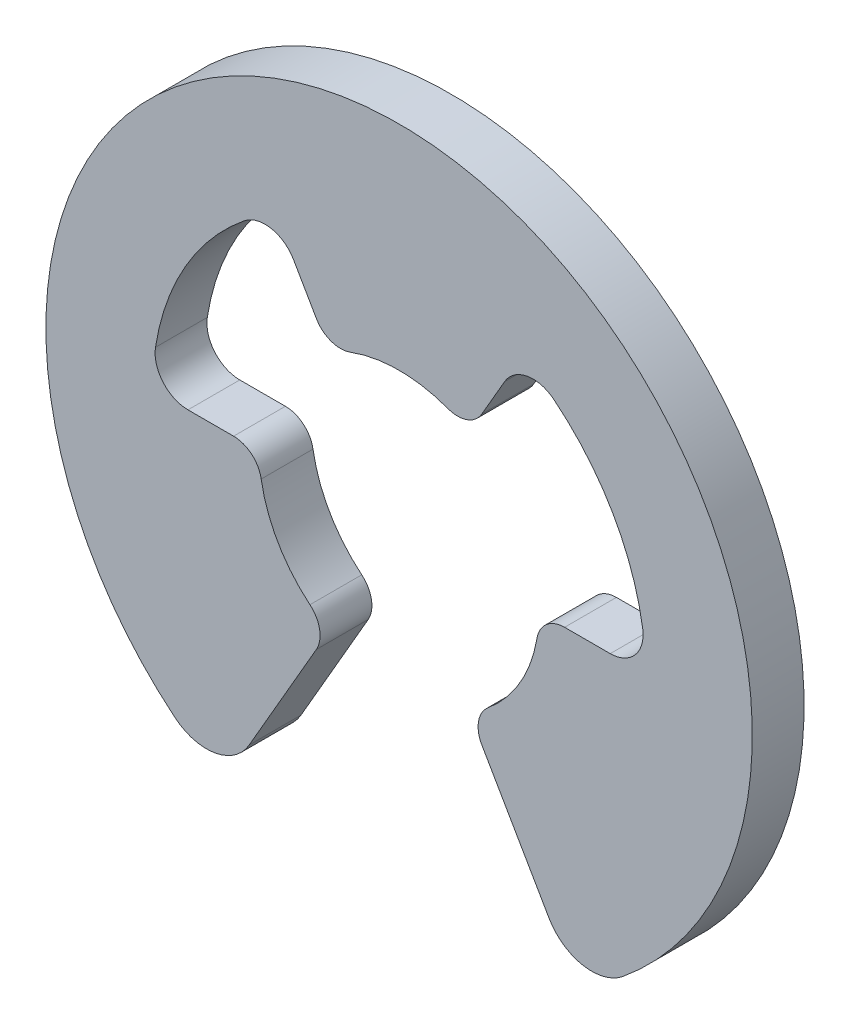
ISO-10303-21;
HEADER;
FILE_DESCRIPTION(('STEP AP214'),'2;1');
FILE_NAME('part.step','',(''),(''),'','','');
FILE_SCHEMA(('AUTOMOTIVE_DESIGN { 1 0 10303 214 1 1 1 1 }'));
ENDSEC;
DATA;
#1=APPLICATION_CONTEXT('core data for automotive mechanical design processes');
#2=APPLICATION_PROTOCOL_DEFINITION('international standard','automotive_design',2000,#1);
#3=PRODUCT_CONTEXT('',#1,'mechanical');
#4=PRODUCT('Part','Part','',(#3));
#5=PRODUCT_RELATED_PRODUCT_CATEGORY('part','',(#4));
#6=PRODUCT_DEFINITION_FORMATION('','',#4);
#7=PRODUCT_DEFINITION_CONTEXT('part definition',#1,'design');
#8=PRODUCT_DEFINITION('design','',#6,#7);
#9=PRODUCT_DEFINITION_SHAPE('','',#8);
#10=(LENGTH_UNIT() NAMED_UNIT(*) SI_UNIT(.MILLI.,.METRE.));
#11=(NAMED_UNIT(*) PLANE_ANGLE_UNIT() SI_UNIT($,.RADIAN.));
#12=(NAMED_UNIT(*) SI_UNIT($,.STERADIAN.) SOLID_ANGLE_UNIT());
#13=UNCERTAINTY_MEASURE_WITH_UNIT(LENGTH_MEASURE(1.E-05),#10,'distance_accuracy_value','');
#14=(GEOMETRIC_REPRESENTATION_CONTEXT(3) GLOBAL_UNCERTAINTY_ASSIGNED_CONTEXT((#13)) GLOBAL_UNIT_ASSIGNED_CONTEXT((#10,
#11,#12)) REPRESENTATION_CONTEXT('',''));
#15=CARTESIAN_POINT('',(0.,0.,0.));
#16=DIRECTION('',(0.,0.,1.));
#17=DIRECTION('',(1.,0.,0.));
#18=AXIS2_PLACEMENT_3D('',#15,#16,#17);
#19=CARTESIAN_POINT('',(2.59745250719341,-3.16922971270618,0.34925));
#20=DIRECTION('',(0.,0.,1.));
#21=DIRECTION('',(1.,0.,0.));
#22=AXIS2_PLACEMENT_3D('',#19,#20,#21);
#23=PLANE('',#22);
#24=CARTESIAN_POINT('',(1.44239918874713,-1.74392867970615,0.34925));
#25=DIRECTION('',(0.,0.,1.));
#26=DIRECTION('',(1.,0.,0.));
#27=AXIS2_PLACEMENT_3D('',#24,#25,#26);
#28=CIRCLE('',#27,0.37719);
#29=CARTESIAN_POINT('',(1.11574306669367,-1.93252367970615,0.34925));
#30=VERTEX_POINT('',#29);
#31=CARTESIAN_POINT('',(1.20199932395594,-1.45327389975513,0.34925));
#32=VERTEX_POINT('',#31);
#33=EDGE_CURVE('E200',#30,#32,#28,.F.);
#34=ORIENTED_EDGE('',*,*,#33,.F.);
#35=DIRECTION('',(-0.5,0.866025403784439,0.));
#36=VECTOR('',#35,1.);
#37=CARTESIAN_POINT('',(1.11574306669367,-1.93252367970615,0.34925));
#38=LINE('',#37,#36);
#39=CARTESIAN_POINT('',(2.02167984761435,-3.50165221270617,0.34925));
#40=VERTEX_POINT('',#39);
#41=EDGE_CURVE('E180',#30,#40,#38,.F.);
#42=ORIENTED_EDGE('',*,*,#41,.T.);
#43=CARTESIAN_POINT('',(2.59745250719341,-3.16922971270618,0.34925));
#44=DIRECTION('',(0.,0.,1.));
#45=DIRECTION('',(1.,0.,0.));
#46=AXIS2_PLACEMENT_3D('',#43,#44,#45);
#47=CIRCLE('',#46,0.664845);
#48=CARTESIAN_POINT('',(3.01888947837449,-3.68343760193651,0.34925));
#49=VERTEX_POINT('',#48);
#50=EDGE_CURVE('E20',#40,#49,#47,.T.);
#51=ORIENTED_EDGE('',*,*,#50,.T.);
#52=CARTESIAN_POINT('',(0.,0.,0.34925));
#53=DIRECTION('',(0.,0.,1.));
#54=DIRECTION('',(1.,0.,0.));
#55=AXIS2_PLACEMENT_3D('',#52,#53,#54);
#56=CIRCLE('',#55,4.7625);
#57=CARTESIAN_POINT('',(-3.01888950424871,-3.68343758073039,0.34925));
#58=VERTEX_POINT('',#57);
#59=EDGE_CURVE('E177',#58,#49,#56,.F.);
#60=ORIENTED_EDGE('',*,*,#59,.F.);
#61=CARTESIAN_POINT('',(-2.59745250719341,-3.16922971270618,0.34925));
#62=DIRECTION('',(0.,0.,1.));
#63=DIRECTION('',(1.,0.,0.));
#64=AXIS2_PLACEMENT_3D('',#61,#62,#63);
#65=CIRCLE('',#64,0.664845);
#66=CARTESIAN_POINT('',(-2.02167984761436,-3.50165221270616,0.34925));
#67=VERTEX_POINT('',#66);
#68=EDGE_CURVE('E187',#67,#58,#65,.F.);
#69=ORIENTED_EDGE('',*,*,#68,.F.);
#70=DIRECTION('',(-0.5,-0.866025403784439,0.));
#71=VECTOR('',#70,1.);
#72=CARTESIAN_POINT('',(-2.02167984761436,-3.50165221270616,0.34925));
#73=LINE('',#72,#71);
#74=CARTESIAN_POINT('',(-1.11574306669368,-1.93252367970615,0.34925));
#75=VERTEX_POINT('',#74);
#76=EDGE_CURVE('E271',#67,#75,#73,.F.);
#77=ORIENTED_EDGE('',*,*,#76,.T.);
#78=CARTESIAN_POINT('',(-1.44239918874713,-1.74392867970615,0.34925));
#79=DIRECTION('',(0.,0.,1.));
#80=DIRECTION('',(1.,0.,0.));
#81=AXIS2_PLACEMENT_3D('',#78,#79,#80);
#82=CIRCLE('',#81,0.37719);
#83=CARTESIAN_POINT('',(-1.20199933201188,-1.45327389309208,0.34925));
#84=VERTEX_POINT('',#83);
#85=EDGE_CURVE('E267',#84,#75,#82,.F.);
#86=ORIENTED_EDGE('',*,*,#85,.F.);
#87=CARTESIAN_POINT('',(0.,0.,0.34925));
#88=DIRECTION('',(0.,0.,1.));
#89=DIRECTION('',(1.,0.,0.));
#90=AXIS2_PLACEMENT_3D('',#87,#88,#89);
#91=CIRCLE('',#90,1.88595);
#92=CARTESIAN_POINT('',(-1.85957177782279,-0.314325,0.34925));
#93=VERTEX_POINT('',#92);
#94=EDGE_CURVE('E264',#84,#93,#91,.F.);
#95=ORIENTED_EDGE('',*,*,#94,.T.);
#96=CARTESIAN_POINT('',(-2.23148613338734,-0.37719,0.34925));
#97=DIRECTION('',(0.,0.,1.));
#98=DIRECTION('',(1.,0.,0.));
#99=AXIS2_PLACEMENT_3D('',#96,#97,#98);
#100=CIRCLE('',#99,0.37719);
#101=CARTESIAN_POINT('',(-2.23148613338734,0.,0.34925));
#102=VERTEX_POINT('',#101);
#103=EDGE_CURVE('E260',#102,#93,#100,.F.);
#104=ORIENTED_EDGE('',*,*,#103,.F.);
#105=DIRECTION('',(1.,0.,0.));
#106=VECTOR('',#105,1.);
#107=CARTESIAN_POINT('',(-2.23148613338734,0.,0.34925));
#108=LINE('',#107,#106);
#109=CARTESIAN_POINT('',(-2.84669621792087,0.,0.34925));
#110=VERTEX_POINT('',#109);
#111=EDGE_CURVE('E254',#102,#110,#108,.F.);
#112=ORIENTED_EDGE('',*,*,#111,.T.);
#113=CARTESIAN_POINT('',(-2.84669621792087,0.44323,0.34925));
#114=DIRECTION('',(0.,0.,1.));
#115=DIRECTION('',(1.,0.,0.));
#116=AXIS2_PLACEMENT_3D('',#113,#114,#115);
#117=CIRCLE('',#116,0.44323);
#118=CARTESIAN_POINT('',(-3.28464947869262,0.511419253400979,0.34925));
#119=VERTEX_POINT('',#118);
#120=EDGE_CURVE('E250',#110,#119,#117,.F.);
#121=ORIENTED_EDGE('',*,*,#120,.T.);
#122=CARTESIAN_POINT('',(0.,0.,0.34925));
#123=DIRECTION('',(0.,0.,1.));
#124=DIRECTION('',(1.,0.,0.));
#125=AXIS2_PLACEMENT_3D('',#122,#123,#124);
#126=CIRCLE('',#125,3.32422499999997);
#127=CARTESIAN_POINT('',(-2.085226812992,2.58888025775705,0.34925));
#128=VERTEX_POINT('',#127);
#129=EDGE_CURVE('E246',#119,#128,#126,.F.);
#130=ORIENTED_EDGE('',*,*,#129,.T.);
#131=CARTESIAN_POINT('',(-1.80719654867981,2.24369624157656,0.34925));
#132=DIRECTION('',(0.,0.,1.));
#133=DIRECTION('',(1.,0.,0.));
#134=AXIS2_PLACEMENT_3D('',#131,#132,#133);
#135=CIRCLE('',#134,0.44323);
#136=CARTESIAN_POINT('',(-1.42334810896044,2.46531124157656,0.34925));
#137=VERTEX_POINT('',#136);
#138=EDGE_CURVE('E242',#128,#137,#135,.F.);
#139=ORIENTED_EDGE('',*,*,#138,.T.);
#140=DIRECTION('',(-0.5,0.866025403784439,0.));
#141=VECTOR('',#140,1.);
#142=CARTESIAN_POINT('',(-1.42334810896044,2.46531124157656,0.34925));
#143=LINE('',#142,#141);
#144=CARTESIAN_POINT('',(-1.11574306669367,1.93252367970615,0.34925));
#145=VERTEX_POINT('',#144);
#146=EDGE_CURVE('E241',#137,#145,#143,.F.);
#147=ORIENTED_EDGE('',*,*,#146,.T.);
#148=CARTESIAN_POINT('',(-0.789086944640219,2.12111867970615,0.34925));
#149=DIRECTION('',(0.,0.,1.));
#150=DIRECTION('',(1.,0.,0.));
#151=AXIS2_PLACEMENT_3D('',#148,#149,#150);
#152=CIRCLE('',#151,0.37719);
#153=CARTESIAN_POINT('',(-0.657572449066663,1.76759890154086,0.34925));
#154=VERTEX_POINT('',#153);
#155=EDGE_CURVE('E237',#154,#145,#152,.F.);
#156=ORIENTED_EDGE('',*,*,#155,.F.);
#157=CARTESIAN_POINT('',(0.,0.,0.34925));
#158=DIRECTION('',(0.,0.,1.));
#159=DIRECTION('',(1.,0.,0.));
#160=AXIS2_PLACEMENT_3D('',#157,#158,#159);
#161=CIRCLE('',#160,1.88595);
#162=CARTESIAN_POINT('',(0.657572453866851,1.76759889975512,0.34925));
#163=VERTEX_POINT('',#162);
#164=EDGE_CURVE('E234',#154,#163,#161,.F.);
#165=ORIENTED_EDGE('',*,*,#164,.T.);
#166=CARTESIAN_POINT('',(0.789086944640221,2.12111867970615,0.34925));
#167=DIRECTION('',(0.,0.,1.));
#168=DIRECTION('',(1.,0.,0.));
#169=AXIS2_PLACEMENT_3D('',#166,#167,#168);
#170=CIRCLE('',#169,0.37719);
#171=CARTESIAN_POINT('',(1.11574306669367,1.93252367970615,0.34925));
#172=VERTEX_POINT('',#171);
#173=EDGE_CURVE('E230',#172,#163,#170,.F.);
#174=ORIENTED_EDGE('',*,*,#173,.F.);
#175=DIRECTION('',(-0.5,-0.866025403784438,0.));
#176=VECTOR('',#175,1.);
#177=CARTESIAN_POINT('',(1.11574306669367,1.93252367970615,0.34925));
#178=LINE('',#177,#176);
#179=CARTESIAN_POINT('',(1.42334810896044,2.46531124157656,0.34925));
#180=VERTEX_POINT('',#179);
#181=EDGE_CURVE('E224',#172,#180,#178,.F.);
#182=ORIENTED_EDGE('',*,*,#181,.T.);
#183=CARTESIAN_POINT('',(1.80719654867981,2.24369624157656,0.34925));
#184=DIRECTION('',(0.,0.,1.));
#185=DIRECTION('',(1.,0.,0.));
#186=AXIS2_PLACEMENT_3D('',#183,#184,#185);
#187=CIRCLE('',#186,0.44323);
#188=CARTESIAN_POINT('',(2.08522677663959,2.58888028703728,0.34925));
#189=VERTEX_POINT('',#188);
#190=EDGE_CURVE('E220',#180,#189,#187,.F.);
#191=ORIENTED_EDGE('',*,*,#190,.T.);
#192=CARTESIAN_POINT('',(0.,0.,0.34925));
#193=DIRECTION('',(0.,0.,1.));
#194=DIRECTION('',(1.,0.,0.));
#195=AXIS2_PLACEMENT_3D('',#192,#193,#194);
#196=CIRCLE('',#195,3.324225);
#197=CARTESIAN_POINT('',(3.28464948221639,0.511419230769231,0.34925));
#198=VERTEX_POINT('',#197);
#199=EDGE_CURVE('E216',#189,#198,#196,.F.);
#200=ORIENTED_EDGE('',*,*,#199,.T.);
#201=CARTESIAN_POINT('',(2.84669621792087,0.44323,0.34925));
#202=DIRECTION('',(0.,0.,1.));
#203=DIRECTION('',(1.,0.,0.));
#204=AXIS2_PLACEMENT_3D('',#201,#202,#203);
#205=CIRCLE('',#204,0.44323);
#206=CARTESIAN_POINT('',(2.84669621792087,0.,0.34925));
#207=VERTEX_POINT('',#206);
#208=EDGE_CURVE('E212',#198,#207,#205,.F.);
#209=ORIENTED_EDGE('',*,*,#208,.T.);
#210=DIRECTION('',(1.,0.,0.));
#211=VECTOR('',#210,1.);
#212=CARTESIAN_POINT('',(2.84669621792087,0.,0.34925));
#213=LINE('',#212,#211);
#214=CARTESIAN_POINT('',(2.23148613338734,0.,0.34925));
#215=VERTEX_POINT('',#214);
#216=EDGE_CURVE('E211',#207,#215,#213,.F.);
#217=ORIENTED_EDGE('',*,*,#216,.T.);
#218=CARTESIAN_POINT('',(2.23148613338734,-0.37719,0.34925));
#219=DIRECTION('',(0.,0.,1.));
#220=DIRECTION('',(1.,0.,0.));
#221=AXIS2_PLACEMENT_3D('',#218,#219,#220);
#222=CIRCLE('',#221,0.37719);
#223=CARTESIAN_POINT('',(1.85957177782279,-0.314325,0.34925));
#224=VERTEX_POINT('',#223);
#225=EDGE_CURVE('E207',#224,#215,#222,.F.);
#226=ORIENTED_EDGE('',*,*,#225,.F.);
#227=CARTESIAN_POINT('',(0.,0.,0.34925));
#228=DIRECTION('',(0.,0.,1.));
#229=DIRECTION('',(1.,0.,0.));
#230=AXIS2_PLACEMENT_3D('',#227,#228,#229);
#231=CIRCLE('',#230,1.88595);
#232=EDGE_CURVE('E204',#224,#32,#231,.F.);
#233=ORIENTED_EDGE('',*,*,#232,.T.);
#234=EDGE_LOOP('',(#34,#42,#51,#60,#69,#77,#86,#95,#104,#112,#121,#130,#139,#147,#156,#165,#174,
#182,#191,#200,#209,#217,#226,#233));
#235=FACE_BOUND('',#234,.T.);
#236=ADVANCED_FACE('F17',(#235),#23,.T.);
#237=CARTESIAN_POINT('',(0.,0.,0.34925));
#238=DIRECTION('',(0.,0.,1.));
#239=DIRECTION('',(1.,0.,0.));
#240=AXIS2_PLACEMENT_3D('',#237,#238,#239);
#241=CYLINDRICAL_SURFACE('',#240,4.7625);
#242=ORIENTED_EDGE('',*,*,#59,.T.);
#243=DIRECTION('',(0.,0.,1.));
#244=VECTOR('',#243,1.);
#245=CARTESIAN_POINT('',(3.0188894783745,-3.68343760193651,0.34925));
#246=LINE('',#245,#244);
#247=CARTESIAN_POINT('',(3.01888947837449,-3.68343760193651,-0.34925));
#248=VERTEX_POINT('',#247);
#249=EDGE_CURVE('E185',#248,#49,#246,.T.);
#250=ORIENTED_EDGE('',*,*,#249,.F.);
#251=CARTESIAN_POINT('',(0.,0.,-0.34925));
#252=DIRECTION('',(0.,0.,1.));
#253=DIRECTION('',(1.,0.,0.));
#254=AXIS2_PLACEMENT_3D('',#251,#252,#253);
#255=CIRCLE('',#254,4.7625);
#256=CARTESIAN_POINT('',(-3.01888950424871,-3.68343758073039,-0.34925));
#257=VERTEX_POINT('',#256);
#258=EDGE_CURVE('E190',#248,#257,#255,.T.);
#259=ORIENTED_EDGE('',*,*,#258,.T.);
#260=DIRECTION('',(0.,0.,1.));
#261=VECTOR('',#260,1.);
#262=CARTESIAN_POINT('',(-3.01888953012294,-3.68343755952427,0.34925));
#263=LINE('',#262,#261);
#264=EDGE_CURVE('E186',#58,#257,#263,.F.);
#265=ORIENTED_EDGE('',*,*,#264,.F.);
#266=EDGE_LOOP('',(#242,#250,#259,#265));
#267=FACE_BOUND('',#266,.T.);
#268=ADVANCED_FACE('F183',(#267),#241,.T.);
#269=CARTESIAN_POINT('',(-2.59745250719341,-3.16922971270618,0.34925));
#270=DIRECTION('',(0.,0.,1.));
#271=DIRECTION('',(1.,0.,0.));
#272=AXIS2_PLACEMENT_3D('',#269,#270,#271);
#273=CYLINDRICAL_SURFACE('',#272,0.664845);
#274=ORIENTED_EDGE('',*,*,#68,.T.);
#275=ORIENTED_EDGE('',*,*,#264,.T.);
#276=CARTESIAN_POINT('',(-2.59745250719341,-3.16922971270618,-0.34925));
#277=DIRECTION('',(0.,0.,1.));
#278=DIRECTION('',(1.,0.,0.));
#279=AXIS2_PLACEMENT_3D('',#276,#277,#278);
#280=CIRCLE('',#279,0.664845);
#281=CARTESIAN_POINT('',(-2.02167984761436,-3.50165221270616,-0.34925));
#282=VERTEX_POINT('',#281);
#283=EDGE_CURVE('E331',#257,#282,#280,.T.);
#284=ORIENTED_EDGE('',*,*,#283,.T.);
#285=DIRECTION('',(0.,0.,1.));
#286=VECTOR('',#285,1.);
#287=CARTESIAN_POINT('',(-2.02167984761436,-3.50165221270615,0.34925));
#288=LINE('',#287,#286);
#289=EDGE_CURVE('E268',#282,#67,#288,.T.);
#290=ORIENTED_EDGE('',*,*,#289,.T.);
#291=EDGE_LOOP('',(#274,#275,#284,#290));
#292=FACE_BOUND('',#291,.T.);
#293=ADVANCED_FACE('F354',(#292),#273,.T.);
#294=CARTESIAN_POINT('',(-2.02167984761436,-3.50165221270616,0.34925));
#295=DIRECTION('',(-0.866025403784439,0.5,0.));
#296=DIRECTION('',(-0.5,-0.866025403784439,0.));
#297=AXIS2_PLACEMENT_3D('',#294,#295,#296);
#298=PLANE('',#297);
#299=DIRECTION('',(0.,0.,1.));
#300=VECTOR('',#299,1.);
#301=CARTESIAN_POINT('',(-1.11574306669367,-1.93252367970615,0.34925));
#302=LINE('',#301,#300);
#303=CARTESIAN_POINT('',(-1.11574306669367,-1.93252367970615,-0.34925));
#304=VERTEX_POINT('',#303);
#305=EDGE_CURVE('E265',#75,#304,#302,.F.);
#306=ORIENTED_EDGE('',*,*,#305,.F.);
#307=ORIENTED_EDGE('',*,*,#76,.F.);
#308=ORIENTED_EDGE('',*,*,#289,.F.);
#309=DIRECTION('',(0.500000000000002,0.866025403784438,0.));
#310=VECTOR('',#309,1.);
#311=CARTESIAN_POINT('',(-2.02167984761435,-3.50165221270616,-0.34925));
#312=LINE('',#311,#310);
#313=EDGE_CURVE('E330',#282,#304,#312,.T.);
#314=ORIENTED_EDGE('',*,*,#313,.T.);
#315=EDGE_LOOP('',(#306,#307,#308,#314));
#316=FACE_BOUND('',#315,.T.);
#317=ADVANCED_FACE('F359',(#316),#298,.F.);
#318=CARTESIAN_POINT('',(-1.44239918874713,-1.74392867970615,0.34925));
#319=DIRECTION('',(0.,0.,1.));
#320=DIRECTION('',(1.,0.,0.));
#321=AXIS2_PLACEMENT_3D('',#318,#319,#320);
#322=CYLINDRICAL_SURFACE('',#321,0.37719);
#323=ORIENTED_EDGE('',*,*,#85,.T.);
#324=ORIENTED_EDGE('',*,*,#305,.T.);
#325=CARTESIAN_POINT('',(-1.44239918874713,-1.74392867970615,-0.34925));
#326=DIRECTION('',(0.,0.,1.));
#327=DIRECTION('',(1.,0.,0.));
#328=AXIS2_PLACEMENT_3D('',#325,#326,#327);
#329=CIRCLE('',#328,0.37719);
#330=CARTESIAN_POINT('',(-1.20199933201188,-1.45327389309208,-0.34925));
#331=VERTEX_POINT('',#330);
#332=EDGE_CURVE('E327',#304,#331,#329,.T.);
#333=ORIENTED_EDGE('',*,*,#332,.T.);
#334=DIRECTION('',(0.,0.,1.));
#335=VECTOR('',#334,1.);
#336=CARTESIAN_POINT('',(-1.20199934006782,-1.45327388642903,0.34925));
#337=LINE('',#336,#335);
#338=EDGE_CURVE('E261',#331,#84,#337,.T.);
#339=ORIENTED_EDGE('',*,*,#338,.T.);
#340=EDGE_LOOP('',(#323,#324,#333,#339));
#341=FACE_BOUND('',#340,.T.);
#342=ADVANCED_FACE('F364',(#341),#322,.T.);
#343=CARTESIAN_POINT('',(0.,0.,0.34925));
#344=DIRECTION('',(0.,0.,1.));
#345=DIRECTION('',(1.,0.,0.));
#346=AXIS2_PLACEMENT_3D('',#343,#344,#345);
#347=CYLINDRICAL_SURFACE('',#346,1.88595);
#348=DIRECTION('',(0.,0.,1.));
#349=VECTOR('',#348,1.);
#350=CARTESIAN_POINT('',(-1.85957177782279,-0.314325,0.34925));
#351=LINE('',#350,#349);
#352=CARTESIAN_POINT('',(-1.85957177782279,-0.314325,-0.34925));
#353=VERTEX_POINT('',#352);
#354=EDGE_CURVE('E258',#93,#353,#351,.F.);
#355=ORIENTED_EDGE('',*,*,#354,.F.);
#356=ORIENTED_EDGE('',*,*,#94,.F.);
#357=ORIENTED_EDGE('',*,*,#338,.F.);
#358=CARTESIAN_POINT('',(0.,0.,-0.34925));
#359=DIRECTION('',(0.,0.,1.));
#360=DIRECTION('',(1.,0.,0.));
#361=AXIS2_PLACEMENT_3D('',#358,#359,#360);
#362=CIRCLE('',#361,1.88595);
#363=EDGE_CURVE('E324',#331,#353,#362,.F.);
#364=ORIENTED_EDGE('',*,*,#363,.T.);
#365=EDGE_LOOP('',(#355,#356,#357,#364));
#366=FACE_BOUND('',#365,.T.);
#367=ADVANCED_FACE('F373',(#366),#347,.F.);
#368=CARTESIAN_POINT('',(-2.23148613338734,-0.37719,0.34925));
#369=DIRECTION('',(0.,0.,1.));
#370=DIRECTION('',(1.,0.,0.));
#371=AXIS2_PLACEMENT_3D('',#368,#369,#370);
#372=CYLINDRICAL_SURFACE('',#371,0.37719);
#373=ORIENTED_EDGE('',*,*,#103,.T.);
#374=ORIENTED_EDGE('',*,*,#354,.T.);
#375=CARTESIAN_POINT('',(-2.23148613338734,-0.37719,-0.34925));
#376=DIRECTION('',(0.,0.,1.));
#377=DIRECTION('',(1.,0.,0.));
#378=AXIS2_PLACEMENT_3D('',#375,#376,#377);
#379=CIRCLE('',#378,0.37719);
#380=CARTESIAN_POINT('',(-2.23148613338734,0.,-0.34925));
#381=VERTEX_POINT('',#380);
#382=EDGE_CURVE('E321',#353,#381,#379,.T.);
#383=ORIENTED_EDGE('',*,*,#382,.T.);
#384=DIRECTION('',(0.,0.,-1.));
#385=VECTOR('',#384,1.);
#386=CARTESIAN_POINT('',(-2.23148613338734,0.,0.34925));
#387=LINE('',#386,#385);
#388=EDGE_CURVE('E255',#381,#102,#387,.F.);
#389=ORIENTED_EDGE('',*,*,#388,.T.);
#390=EDGE_LOOP('',(#373,#374,#383,#389));
#391=FACE_BOUND('',#390,.T.);
#392=ADVANCED_FACE('F381',(#391),#372,.T.);
#393=CARTESIAN_POINT('',(-2.23148613338734,0.,0.34925));
#394=DIRECTION('',(0.,-1.,0.));
#395=DIRECTION('',(0.,0.,-1.));
#396=AXIS2_PLACEMENT_3D('',#393,#394,#395);
#397=PLANE('',#396);
#398=DIRECTION('',(0.,0.,1.));
#399=VECTOR('',#398,1.);
#400=CARTESIAN_POINT('',(-2.84669621792087,0.,0.34925));
#401=LINE('',#400,#399);
#402=CARTESIAN_POINT('',(-2.84669621792087,0.,-0.34925));
#403=VERTEX_POINT('',#402);
#404=EDGE_CURVE('E251',#403,#110,#401,.T.);
#405=ORIENTED_EDGE('',*,*,#404,.T.);
#406=ORIENTED_EDGE('',*,*,#111,.F.);
#407=ORIENTED_EDGE('',*,*,#388,.F.);
#408=DIRECTION('',(1.,0.,0.));
#409=VECTOR('',#408,1.);
#410=CARTESIAN_POINT('',(2.59745250719341,0.,-0.34925));
#411=LINE('',#410,#409);
#412=EDGE_CURVE('E320',#381,#403,#411,.F.);
#413=ORIENTED_EDGE('',*,*,#412,.T.);
#414=EDGE_LOOP('',(#405,#406,#407,#413));
#415=FACE_BOUND('',#414,.T.);
#416=ADVANCED_FACE('F379',(#415),#397,.F.);
#417=CARTESIAN_POINT('',(-2.84669621792087,0.44323,0.34925));
#418=DIRECTION('',(0.,0.,1.));
#419=DIRECTION('',(1.,0.,0.));
#420=AXIS2_PLACEMENT_3D('',#417,#418,#419);
#421=CYLINDRICAL_SURFACE('',#420,0.44323);
#422=DIRECTION('',(0.,0.,1.));
#423=VECTOR('',#422,1.);
#424=CARTESIAN_POINT('',(-3.28464947516886,0.511419276032728,0.34925));
#425=LINE('',#424,#423);
#426=CARTESIAN_POINT('',(-3.28464947869262,0.511419253400978,-0.34925));
#427=VERTEX_POINT('',#426);
#428=EDGE_CURVE('E247',#427,#119,#425,.T.);
#429=ORIENTED_EDGE('',*,*,#428,.T.);
#430=ORIENTED_EDGE('',*,*,#120,.F.);
#431=ORIENTED_EDGE('',*,*,#404,.F.);
#432=CARTESIAN_POINT('',(-2.84669621792087,0.44323,-0.34925));
#433=DIRECTION('',(0.,0.,1.));
#434=DIRECTION('',(1.,0.,0.));
#435=AXIS2_PLACEMENT_3D('',#432,#433,#434);
#436=CIRCLE('',#435,0.44323);
#437=EDGE_CURVE('E317',#403,#427,#436,.F.);
#438=ORIENTED_EDGE('',*,*,#437,.T.);
#439=EDGE_LOOP('',(#429,#430,#431,#438));
#440=FACE_BOUND('',#439,.T.);
#441=ADVANCED_FACE('F389',(#440),#421,.F.);
#442=CARTESIAN_POINT('',(0.,0.,0.34925));
#443=DIRECTION('',(0.,0.,1.));
#444=DIRECTION('',(1.,0.,0.));
#445=AXIS2_PLACEMENT_3D('',#442,#443,#444);
#446=CYLINDRICAL_SURFACE('',#445,3.32422499999997);
#447=DIRECTION('',(0.,0.,1.));
#448=VECTOR('',#447,1.);
#449=CARTESIAN_POINT('',(-2.08522683904576,2.58888023677192,0.34925));
#450=LINE('',#449,#448);
#451=CARTESIAN_POINT('',(-2.085226812992,2.58888025775705,-0.34925));
#452=VERTEX_POINT('',#451);
#453=EDGE_CURVE('E243',#452,#128,#450,.T.);
#454=ORIENTED_EDGE('',*,*,#453,.T.);
#455=ORIENTED_EDGE('',*,*,#129,.F.);
#456=ORIENTED_EDGE('',*,*,#428,.F.);
#457=CARTESIAN_POINT('',(0.,0.,-0.34925));
#458=DIRECTION('',(0.,0.,1.));
#459=DIRECTION('',(1.,0.,0.));
#460=AXIS2_PLACEMENT_3D('',#457,#458,#459);
#461=CIRCLE('',#460,3.32422499999997);
#462=EDGE_CURVE('E314',#427,#452,#461,.F.);
#463=ORIENTED_EDGE('',*,*,#462,.T.);
#464=EDGE_LOOP('',(#454,#455,#456,#463));
#465=FACE_BOUND('',#464,.T.);
#466=ADVANCED_FACE('F454',(#465),#446,.F.);
#467=CARTESIAN_POINT('',(-1.80719654867981,2.24369624157656,0.34925));
#468=DIRECTION('',(0.,0.,1.));
#469=DIRECTION('',(1.,0.,0.));
#470=AXIS2_PLACEMENT_3D('',#467,#468,#469);
#471=CYLINDRICAL_SURFACE('',#470,0.44323);
#472=DIRECTION('',(0.,0.,1.));
#473=VECTOR('',#472,1.);
#474=CARTESIAN_POINT('',(-1.42334810896044,2.46531124157656,0.34925));
#475=LINE('',#474,#473);
#476=CARTESIAN_POINT('',(-1.42334810896044,2.46531124157656,-0.34925));
#477=VERTEX_POINT('',#476);
#478=EDGE_CURVE('E238',#477,#137,#475,.T.);
#479=ORIENTED_EDGE('',*,*,#478,.T.);
#480=ORIENTED_EDGE('',*,*,#138,.F.);
#481=ORIENTED_EDGE('',*,*,#453,.F.);
#482=CARTESIAN_POINT('',(-1.80719654867981,2.24369624157656,-0.34925));
#483=DIRECTION('',(0.,0.,1.));
#484=DIRECTION('',(1.,0.,0.));
#485=AXIS2_PLACEMENT_3D('',#482,#483,#484);
#486=CIRCLE('',#485,0.44323);
#487=EDGE_CURVE('E311',#452,#477,#486,.F.);
#488=ORIENTED_EDGE('',*,*,#487,.T.);
#489=EDGE_LOOP('',(#479,#480,#481,#488));
#490=FACE_BOUND('',#489,.T.);
#491=ADVANCED_FACE('F450',(#490),#471,.F.);
#492=CARTESIAN_POINT('',(-1.42334810896044,2.46531124157656,0.34925));
#493=DIRECTION('',(0.866025403784439,0.5,0.));
#494=DIRECTION('',(-0.5,0.866025403784439,0.));
#495=AXIS2_PLACEMENT_3D('',#492,#493,#494);
#496=PLANE('',#495);
#497=DIRECTION('',(0.,0.,1.));
#498=VECTOR('',#497,1.);
#499=CARTESIAN_POINT('',(-1.11574306669367,1.93252367970615,0.34925));
#500=LINE('',#499,#498);
#501=CARTESIAN_POINT('',(-1.11574306669367,1.93252367970615,-0.34925));
#502=VERTEX_POINT('',#501);
#503=EDGE_CURVE('E235',#145,#502,#500,.F.);
#504=ORIENTED_EDGE('',*,*,#503,.F.);
#505=ORIENTED_EDGE('',*,*,#146,.F.);
#506=ORIENTED_EDGE('',*,*,#478,.F.);
#507=DIRECTION('',(0.5,-0.866025403784438,0.));
#508=VECTOR('',#507,1.);
#509=CARTESIAN_POINT('',(-1.42334810896044,2.46531124157656,-0.34925));
#510=LINE('',#509,#508);
#511=EDGE_CURVE('E310',#477,#502,#510,.T.);
#512=ORIENTED_EDGE('',*,*,#511,.T.);
#513=EDGE_LOOP('',(#504,#505,#506,#512));
#514=FACE_BOUND('',#513,.T.);
#515=ADVANCED_FACE('F446',(#514),#496,.F.);
#516=CARTESIAN_POINT('',(-0.789086944640219,2.12111867970615,0.34925));
#517=DIRECTION('',(0.,0.,1.));
#518=DIRECTION('',(1.,0.,0.));
#519=AXIS2_PLACEMENT_3D('',#516,#517,#518);
#520=CYLINDRICAL_SURFACE('',#519,0.37719);
#521=ORIENTED_EDGE('',*,*,#155,.T.);
#522=ORIENTED_EDGE('',*,*,#503,.T.);
#523=CARTESIAN_POINT('',(-0.789086944640219,2.12111867970615,-0.34925));
#524=DIRECTION('',(0.,0.,1.));
#525=DIRECTION('',(1.,0.,0.));
#526=AXIS2_PLACEMENT_3D('',#523,#524,#525);
#527=CIRCLE('',#526,0.37719);
#528=CARTESIAN_POINT('',(-0.657572449066663,1.76759890154086,-0.34925));
#529=VERTEX_POINT('',#528);
#530=EDGE_CURVE('E307',#502,#529,#527,.T.);
#531=ORIENTED_EDGE('',*,*,#530,.T.);
#532=DIRECTION('',(0.,0.,1.));
#533=VECTOR('',#532,1.);
#534=CARTESIAN_POINT('',(-0.657572444266476,1.7675989033266,0.34925));
#535=LINE('',#534,#533);
#536=EDGE_CURVE('E231',#529,#154,#535,.T.);
#537=ORIENTED_EDGE('',*,*,#536,.T.);
#538=EDGE_LOOP('',(#521,#522,#531,#537));
#539=FACE_BOUND('',#538,.T.);
#540=ADVANCED_FACE('F442',(#539),#520,.T.);
#541=CARTESIAN_POINT('',(0.,0.,0.34925));
#542=DIRECTION('',(0.,0.,1.));
#543=DIRECTION('',(1.,0.,0.));
#544=AXIS2_PLACEMENT_3D('',#541,#542,#543);
#545=CYLINDRICAL_SURFACE('',#544,1.88595);
#546=DIRECTION('',(0.,0.,1.));
#547=VECTOR('',#546,1.);
#548=CARTESIAN_POINT('',(0.657572453866851,1.76759889975513,0.34925));
#549=LINE('',#548,#547);
#550=CARTESIAN_POINT('',(0.657572453866851,1.76759889975512,-0.34925));
#551=VERTEX_POINT('',#550);
#552=EDGE_CURVE('E228',#163,#551,#549,.F.);
#553=ORIENTED_EDGE('',*,*,#552,.F.);
#554=ORIENTED_EDGE('',*,*,#164,.F.);
#555=ORIENTED_EDGE('',*,*,#536,.F.);
#556=CARTESIAN_POINT('',(0.,0.,-0.34925));
#557=DIRECTION('',(0.,0.,1.));
#558=DIRECTION('',(1.,0.,0.));
#559=AXIS2_PLACEMENT_3D('',#556,#557,#558);
#560=CIRCLE('',#559,1.88595);
#561=EDGE_CURVE('E304',#529,#551,#560,.F.);
#562=ORIENTED_EDGE('',*,*,#561,.T.);
#563=EDGE_LOOP('',(#553,#554,#555,#562));
#564=FACE_BOUND('',#563,.T.);
#565=ADVANCED_FACE('F438',(#564),#545,.F.);
#566=CARTESIAN_POINT('',(0.789086944640221,2.12111867970615,0.34925));
#567=DIRECTION('',(0.,0.,1.));
#568=DIRECTION('',(1.,0.,0.));
#569=AXIS2_PLACEMENT_3D('',#566,#567,#568);
#570=CYLINDRICAL_SURFACE('',#569,0.37719);
#571=ORIENTED_EDGE('',*,*,#173,.T.);
#572=ORIENTED_EDGE('',*,*,#552,.T.);
#573=CARTESIAN_POINT('',(0.789086944640221,2.12111867970615,-0.34925));
#574=DIRECTION('',(0.,0.,1.));
#575=DIRECTION('',(1.,0.,0.));
#576=AXIS2_PLACEMENT_3D('',#573,#574,#575);
#577=CIRCLE('',#576,0.37719);
#578=CARTESIAN_POINT('',(1.11574306669367,1.93252367970615,-0.34925));
#579=VERTEX_POINT('',#578);
#580=EDGE_CURVE('E301',#551,#579,#577,.T.);
#581=ORIENTED_EDGE('',*,*,#580,.T.);
#582=DIRECTION('',(0.,0.,1.));
#583=VECTOR('',#582,1.);
#584=CARTESIAN_POINT('',(1.11574306669367,1.93252367970615,0.34925));
#585=LINE('',#584,#583);
#586=EDGE_CURVE('E225',#579,#172,#585,.T.);
#587=ORIENTED_EDGE('',*,*,#586,.T.);
#588=EDGE_LOOP('',(#571,#572,#581,#587));
#589=FACE_BOUND('',#588,.T.);
#590=ADVANCED_FACE('F434',(#589),#570,.T.);
#591=CARTESIAN_POINT('',(1.11574306669367,1.93252367970615,0.34925));
#592=DIRECTION('',(-0.866025403784438,0.5,0.));
#593=DIRECTION('',(-0.5,-0.866025403784438,0.));
#594=AXIS2_PLACEMENT_3D('',#591,#592,#593);
#595=PLANE('',#594);
#596=DIRECTION('',(0.,0.,1.));
#597=VECTOR('',#596,1.);
#598=CARTESIAN_POINT('',(1.42334810896044,2.46531124157656,0.34925));
#599=LINE('',#598,#597);
#600=CARTESIAN_POINT('',(1.42334810896044,2.46531124157656,-0.34925));
#601=VERTEX_POINT('',#600);
#602=EDGE_CURVE('E221',#601,#180,#599,.T.);
#603=ORIENTED_EDGE('',*,*,#602,.T.);
#604=ORIENTED_EDGE('',*,*,#181,.F.);
#605=ORIENTED_EDGE('',*,*,#586,.F.);
#606=DIRECTION('',(0.500000000000001,0.866025403784438,0.));
#607=VECTOR('',#606,1.);
#608=CARTESIAN_POINT('',(1.11574306669367,1.93252367970615,-0.34925));
#609=LINE('',#608,#607);
#610=EDGE_CURVE('E300',#579,#601,#609,.T.);
#611=ORIENTED_EDGE('',*,*,#610,.T.);
#612=EDGE_LOOP('',(#603,#604,#605,#611));
#613=FACE_BOUND('',#612,.T.);
#614=ADVANCED_FACE('F430',(#613),#595,.F.);
#615=CARTESIAN_POINT('',(1.80719654867981,2.24369624157656,0.34925));
#616=DIRECTION('',(0.,0.,1.));
#617=DIRECTION('',(1.,0.,0.));
#618=AXIS2_PLACEMENT_3D('',#615,#616,#617);
#619=CYLINDRICAL_SURFACE('',#618,0.44323);
#620=DIRECTION('',(0.,0.,1.));
#621=VECTOR('',#620,1.);
#622=CARTESIAN_POINT('',(2.08522676634094,2.58888029533238,0.34925));
#623=LINE('',#622,#621);
#624=CARTESIAN_POINT('',(2.08522677663959,2.58888028703728,-0.34925));
#625=VERTEX_POINT('',#624);
#626=EDGE_CURVE('E217',#625,#189,#623,.T.);
#627=ORIENTED_EDGE('',*,*,#626,.T.);
#628=ORIENTED_EDGE('',*,*,#190,.F.);
#629=ORIENTED_EDGE('',*,*,#602,.F.);
#630=CARTESIAN_POINT('',(1.80719654867981,2.24369624157656,-0.34925));
#631=DIRECTION('',(0.,0.,1.));
#632=DIRECTION('',(1.,0.,0.));
#633=AXIS2_PLACEMENT_3D('',#630,#631,#632);
#634=CIRCLE('',#633,0.44323);
#635=EDGE_CURVE('E297',#601,#625,#634,.F.);
#636=ORIENTED_EDGE('',*,*,#635,.T.);
#637=EDGE_LOOP('',(#627,#628,#629,#636));
#638=FACE_BOUND('',#637,.T.);
#639=ADVANCED_FACE('F426',(#638),#619,.F.);
#640=CARTESIAN_POINT('',(0.,0.,0.34925));
#641=DIRECTION('',(0.,0.,1.));
#642=DIRECTION('',(1.,0.,0.));
#643=AXIS2_PLACEMENT_3D('',#640,#641,#642);
#644=CYLINDRICAL_SURFACE('',#643,3.324225);
#645=DIRECTION('',(0.,0.,1.));
#646=VECTOR('',#645,1.);
#647=CARTESIAN_POINT('',(3.28464948221639,0.51141923076923,0.34925));
#648=LINE('',#647,#646);
#649=CARTESIAN_POINT('',(3.28464948221639,0.51141923076923,-0.34925));
#650=VERTEX_POINT('',#649);
#651=EDGE_CURVE('E213',#650,#198,#648,.T.);
#652=ORIENTED_EDGE('',*,*,#651,.T.);
#653=ORIENTED_EDGE('',*,*,#199,.F.);
#654=ORIENTED_EDGE('',*,*,#626,.F.);
#655=CARTESIAN_POINT('',(0.,0.,-0.34925));
#656=DIRECTION('',(0.,0.,1.));
#657=DIRECTION('',(1.,0.,0.));
#658=AXIS2_PLACEMENT_3D('',#655,#656,#657);
#659=CIRCLE('',#658,3.324225);
#660=EDGE_CURVE('E294',#625,#650,#659,.F.);
#661=ORIENTED_EDGE('',*,*,#660,.T.);
#662=EDGE_LOOP('',(#652,#653,#654,#661));
#663=FACE_BOUND('',#662,.T.);
#664=ADVANCED_FACE('F422',(#663),#644,.F.);
#665=CARTESIAN_POINT('',(2.84669621792087,0.44323,0.34925));
#666=DIRECTION('',(0.,0.,1.));
#667=DIRECTION('',(1.,0.,0.));
#668=AXIS2_PLACEMENT_3D('',#665,#666,#667);
#669=CYLINDRICAL_SURFACE('',#668,0.44323);
#670=DIRECTION('',(0.,0.,-1.));
#671=VECTOR('',#670,1.);
#672=CARTESIAN_POINT('',(2.84669621792087,0.,0.34925));
#673=LINE('',#672,#671);
#674=CARTESIAN_POINT('',(2.84669621792087,0.,-0.34925));
#675=VERTEX_POINT('',#674);
#676=EDGE_CURVE('E208',#675,#207,#673,.F.);
#677=ORIENTED_EDGE('',*,*,#676,.T.);
#678=ORIENTED_EDGE('',*,*,#208,.F.);
#679=ORIENTED_EDGE('',*,*,#651,.F.);
#680=CARTESIAN_POINT('',(2.84669621792087,0.44323,-0.34925));
#681=DIRECTION('',(0.,0.,1.));
#682=DIRECTION('',(1.,0.,0.));
#683=AXIS2_PLACEMENT_3D('',#680,#681,#682);
#684=CIRCLE('',#683,0.44323);
#685=EDGE_CURVE('E291',#650,#675,#684,.F.);
#686=ORIENTED_EDGE('',*,*,#685,.T.);
#687=EDGE_LOOP('',(#677,#678,#679,#686));
#688=FACE_BOUND('',#687,.T.);
#689=ADVANCED_FACE('F418',(#688),#669,.F.);
#690=CARTESIAN_POINT('',(2.84669621792087,0.,0.34925));
#691=DIRECTION('',(0.,-1.,0.));
#692=DIRECTION('',(0.,0.,-1.));
#693=AXIS2_PLACEMENT_3D('',#690,#691,#692);
#694=PLANE('',#693);
#695=DIRECTION('',(0.,0.,1.));
#696=VECTOR('',#695,1.);
#697=CARTESIAN_POINT('',(2.23148613338734,0.,0.34925));
#698=LINE('',#697,#696);
#699=CARTESIAN_POINT('',(2.23148613338734,0.,-0.34925));
#700=VERTEX_POINT('',#699);
#701=EDGE_CURVE('E205',#215,#700,#698,.F.);
#702=ORIENTED_EDGE('',*,*,#701,.F.);
#703=ORIENTED_EDGE('',*,*,#216,.F.);
#704=ORIENTED_EDGE('',*,*,#676,.F.);
#705=DIRECTION('',(1.,0.,0.));
#706=VECTOR('',#705,1.);
#707=CARTESIAN_POINT('',(2.59745250719341,0.,-0.34925));
#708=LINE('',#707,#706);
#709=EDGE_CURVE('E290',#675,#700,#708,.F.);
#710=ORIENTED_EDGE('',*,*,#709,.T.);
#711=EDGE_LOOP('',(#702,#703,#704,#710));
#712=FACE_BOUND('',#711,.T.);
#713=ADVANCED_FACE('F414',(#712),#694,.F.);
#714=CARTESIAN_POINT('',(2.23148613338734,-0.37719,0.34925));
#715=DIRECTION('',(0.,0.,1.));
#716=DIRECTION('',(1.,0.,0.));
#717=AXIS2_PLACEMENT_3D('',#714,#715,#716);
#718=CYLINDRICAL_SURFACE('',#717,0.37719);
#719=ORIENTED_EDGE('',*,*,#225,.T.);
#720=ORIENTED_EDGE('',*,*,#701,.T.);
#721=CARTESIAN_POINT('',(2.23148613338734,-0.37719,-0.34925));
#722=DIRECTION('',(0.,0.,1.));
#723=DIRECTION('',(1.,0.,0.));
#724=AXIS2_PLACEMENT_3D('',#721,#722,#723);
#725=CIRCLE('',#724,0.37719);
#726=CARTESIAN_POINT('',(1.85957177782279,-0.314325,-0.34925));
#727=VERTEX_POINT('',#726);
#728=EDGE_CURVE('E287',#700,#727,#725,.T.);
#729=ORIENTED_EDGE('',*,*,#728,.T.);
#730=DIRECTION('',(0.,0.,1.));
#731=VECTOR('',#730,1.);
#732=CARTESIAN_POINT('',(1.85957177782279,-0.314325,0.34925));
#733=LINE('',#732,#731);
#734=EDGE_CURVE('E201',#727,#224,#733,.T.);
#735=ORIENTED_EDGE('',*,*,#734,.T.);
#736=EDGE_LOOP('',(#719,#720,#729,#735));
#737=FACE_BOUND('',#736,.T.);
#738=ADVANCED_FACE('F410',(#737),#718,.T.);
#739=CARTESIAN_POINT('',(0.,0.,0.34925));
#740=DIRECTION('',(0.,0.,1.));
#741=DIRECTION('',(1.,0.,0.));
#742=AXIS2_PLACEMENT_3D('',#739,#740,#741);
#743=CYLINDRICAL_SURFACE('',#742,1.88595);
#744=DIRECTION('',(0.,0.,1.));
#745=VECTOR('',#744,1.);
#746=CARTESIAN_POINT('',(1.20199932395594,-1.45327389975513,0.34925));
#747=LINE('',#746,#745);
#748=CARTESIAN_POINT('',(1.20199932395594,-1.45327389975513,-0.34925));
#749=VERTEX_POINT('',#748);
#750=EDGE_CURVE('E198',#32,#749,#747,.F.);
#751=ORIENTED_EDGE('',*,*,#750,.F.);
#752=ORIENTED_EDGE('',*,*,#232,.F.);
#753=ORIENTED_EDGE('',*,*,#734,.F.);
#754=CARTESIAN_POINT('',(0.,0.,-0.34925));
#755=DIRECTION('',(0.,0.,1.));
#756=DIRECTION('',(1.,0.,0.));
#757=AXIS2_PLACEMENT_3D('',#754,#755,#756);
#758=CIRCLE('',#757,1.88595);
#759=EDGE_CURVE('E284',#727,#749,#758,.F.);
#760=ORIENTED_EDGE('',*,*,#759,.T.);
#761=EDGE_LOOP('',(#751,#752,#753,#760));
#762=FACE_BOUND('',#761,.T.);
#763=ADVANCED_FACE('F406',(#762),#743,.F.);
#764=CARTESIAN_POINT('',(1.44239918874713,-1.74392867970615,0.34925));
#765=DIRECTION('',(0.,0.,1.));
#766=DIRECTION('',(1.,0.,0.));
#767=AXIS2_PLACEMENT_3D('',#764,#765,#766);
#768=CYLINDRICAL_SURFACE('',#767,0.37719);
#769=ORIENTED_EDGE('',*,*,#33,.T.);
#770=ORIENTED_EDGE('',*,*,#750,.T.);
#771=CARTESIAN_POINT('',(1.44239918874713,-1.74392867970615,-0.34925));
#772=DIRECTION('',(0.,0.,1.));
#773=DIRECTION('',(1.,0.,0.));
#774=AXIS2_PLACEMENT_3D('',#771,#772,#773);
#775=CIRCLE('',#774,0.37719);
#776=CARTESIAN_POINT('',(1.11574306669367,-1.93252367970615,-0.34925));
#777=VERTEX_POINT('',#776);
#778=EDGE_CURVE('E281',#749,#777,#775,.T.);
#779=ORIENTED_EDGE('',*,*,#778,.T.);
#780=DIRECTION('',(0.,0.,1.));
#781=VECTOR('',#780,1.);
#782=CARTESIAN_POINT('',(1.11574306669367,-1.93252367970615,0.34925));
#783=LINE('',#782,#781);
#784=EDGE_CURVE('E192',#777,#30,#783,.T.);
#785=ORIENTED_EDGE('',*,*,#784,.T.);
#786=EDGE_LOOP('',(#769,#770,#779,#785));
#787=FACE_BOUND('',#786,.T.);
#788=ADVANCED_FACE('F402',(#787),#768,.T.);
#789=CARTESIAN_POINT('',(1.11574306669367,-1.93252367970615,0.34925));
#790=DIRECTION('',(0.866025403784439,0.5,0.));
#791=DIRECTION('',(-0.5,0.866025403784439,0.));
#792=AXIS2_PLACEMENT_3D('',#789,#790,#791);
#793=PLANE('',#792);
#794=DIRECTION('',(0.,0.,1.));
#795=VECTOR('',#794,1.);
#796=CARTESIAN_POINT('',(2.02167984761434,-3.50165221270617,0.34925));
#797=LINE('',#796,#795);
#798=CARTESIAN_POINT('',(2.02167984761435,-3.50165221270617,-0.34925));
#799=VERTEX_POINT('',#798);
#800=EDGE_CURVE('E34',#40,#799,#797,.F.);
#801=ORIENTED_EDGE('',*,*,#800,.F.);
#802=ORIENTED_EDGE('',*,*,#41,.F.);
#803=ORIENTED_EDGE('',*,*,#784,.F.);
#804=DIRECTION('',(0.500000000000003,-0.866025403784437,0.));
#805=VECTOR('',#804,1.);
#806=CARTESIAN_POINT('',(1.11574306669367,-1.93252367970615,-0.34925));
#807=LINE('',#806,#805);
#808=EDGE_CURVE('E26',#777,#799,#807,.T.);
#809=ORIENTED_EDGE('',*,*,#808,.T.);
#810=EDGE_LOOP('',(#801,#802,#803,#809));
#811=FACE_BOUND('',#810,.T.);
#812=ADVANCED_FACE('F397',(#811),#793,.F.);
#813=CARTESIAN_POINT('',(2.59745250719341,-3.16922971270618,0.34925));
#814=DIRECTION('',(0.,0.,1.));
#815=DIRECTION('',(1.,0.,0.));
#816=AXIS2_PLACEMENT_3D('',#813,#814,#815);
#817=CYLINDRICAL_SURFACE('',#816,0.664845);
#818=ORIENTED_EDGE('',*,*,#50,.F.);
#819=ORIENTED_EDGE('',*,*,#800,.T.);
#820=CARTESIAN_POINT('',(2.59745250719341,-3.16922971270618,-0.34925));
#821=DIRECTION('',(0.,0.,1.));
#822=DIRECTION('',(1.,0.,0.));
#823=AXIS2_PLACEMENT_3D('',#820,#821,#822);
#824=CIRCLE('',#823,0.664845);
#825=EDGE_CURVE('E11',#799,#248,#824,.T.);
#826=ORIENTED_EDGE('',*,*,#825,.T.);
#827=ORIENTED_EDGE('',*,*,#249,.T.);
#828=EDGE_LOOP('',(#818,#819,#826,#827));
#829=FACE_BOUND('',#828,.T.);
#830=ADVANCED_FACE('F188',(#829),#817,.T.);
#831=CARTESIAN_POINT('',(2.59745250719341,-3.16922971270618,-0.34925));
#832=DIRECTION('',(0.,0.,1.));
#833=DIRECTION('',(1.,0.,0.));
#834=AXIS2_PLACEMENT_3D('',#831,#832,#833);
#835=PLANE('',#834);
#836=ORIENTED_EDGE('',*,*,#808,.F.);
#837=ORIENTED_EDGE('',*,*,#778,.F.);
#838=ORIENTED_EDGE('',*,*,#759,.F.);
#839=ORIENTED_EDGE('',*,*,#728,.F.);
#840=ORIENTED_EDGE('',*,*,#709,.F.);
#841=ORIENTED_EDGE('',*,*,#685,.F.);
#842=ORIENTED_EDGE('',*,*,#660,.F.);
#843=ORIENTED_EDGE('',*,*,#635,.F.);
#844=ORIENTED_EDGE('',*,*,#610,.F.);
#845=ORIENTED_EDGE('',*,*,#580,.F.);
#846=ORIENTED_EDGE('',*,*,#561,.F.);
#847=ORIENTED_EDGE('',*,*,#530,.F.);
#848=ORIENTED_EDGE('',*,*,#511,.F.);
#849=ORIENTED_EDGE('',*,*,#487,.F.);
#850=ORIENTED_EDGE('',*,*,#462,.F.);
#851=ORIENTED_EDGE('',*,*,#437,.F.);
#852=ORIENTED_EDGE('',*,*,#412,.F.);
#853=ORIENTED_EDGE('',*,*,#382,.F.);
#854=ORIENTED_EDGE('',*,*,#363,.F.);
#855=ORIENTED_EDGE('',*,*,#332,.F.);
#856=ORIENTED_EDGE('',*,*,#313,.F.);
#857=ORIENTED_EDGE('',*,*,#283,.F.);
#858=ORIENTED_EDGE('',*,*,#258,.F.);
#859=ORIENTED_EDGE('',*,*,#825,.F.);
#860=EDGE_LOOP('',(#836,#837,#838,#839,#840,#841,#842,#843,#844,#845,#846,#847,#848,#849,#850,
#851,#852,#853,#854,#855,#856,#857,#858,#859));
#861=FACE_BOUND('',#860,.T.);
#862=ADVANCED_FACE('F368',(#861),#835,.F.);
#863=CLOSED_SHELL('',(#236,#268,#293,#317,#342,#367,#392,#416,#441,#466,#491,#515,#540,#565,
#590,#614,#639,#664,#689,#713,#738,#763,#788,#812,#830,#862));
#864=MANIFOLD_SOLID_BREP('B1',#863);
#865=ADVANCED_BREP_SHAPE_REPRESENTATION('',(#18,#864),#14);
#866=SHAPE_DEFINITION_REPRESENTATION(#9,#865);
ENDSEC;
END-ISO-10303-21;
